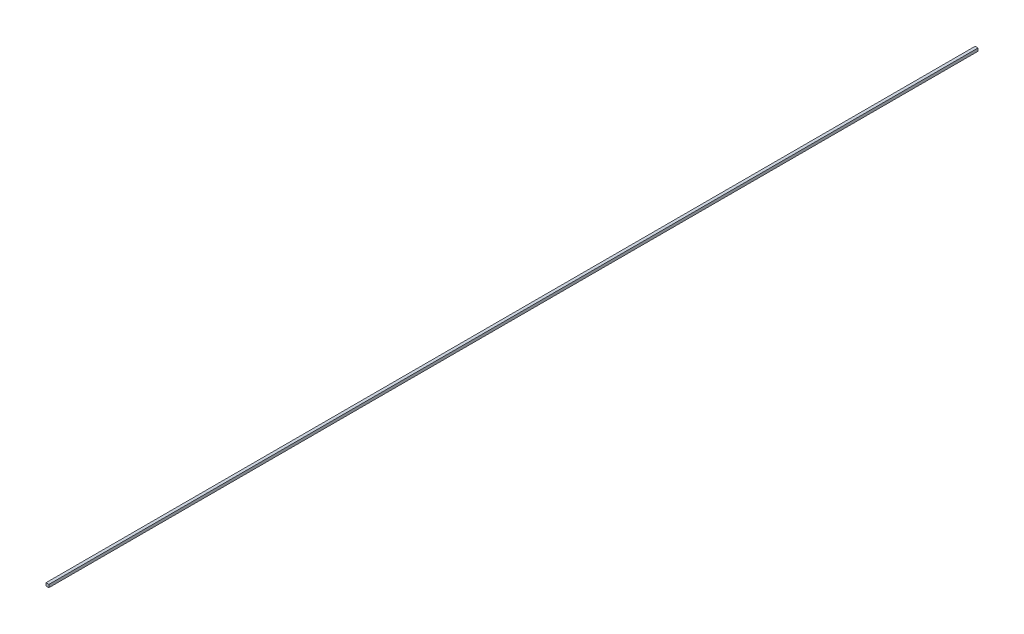
ISO-10303-21;
HEADER;
FILE_DESCRIPTION(('STEP AP214'),'2;1');
FILE_NAME('part.step','',(''),(''),'','','');
FILE_SCHEMA(('AUTOMOTIVE_DESIGN { 1 0 10303 214 1 1 1 1 }'));
ENDSEC;
DATA;
#1=APPLICATION_CONTEXT('core data for automotive mechanical design processes');
#2=APPLICATION_PROTOCOL_DEFINITION('international standard','automotive_design',2000,#1);
#3=PRODUCT_CONTEXT('',#1,'mechanical');
#4=PRODUCT('Part','Part','',(#3));
#5=PRODUCT_RELATED_PRODUCT_CATEGORY('part','',(#4));
#6=PRODUCT_DEFINITION_FORMATION('','',#4);
#7=PRODUCT_DEFINITION_CONTEXT('part definition',#1,'design');
#8=PRODUCT_DEFINITION('design','',#6,#7);
#9=PRODUCT_DEFINITION_SHAPE('','',#8);
#10=(LENGTH_UNIT() NAMED_UNIT(*) SI_UNIT(.MILLI.,.METRE.));
#11=(NAMED_UNIT(*) PLANE_ANGLE_UNIT() SI_UNIT($,.RADIAN.));
#12=(NAMED_UNIT(*) SI_UNIT($,.STERADIAN.) SOLID_ANGLE_UNIT());
#13=UNCERTAINTY_MEASURE_WITH_UNIT(LENGTH_MEASURE(1.E-05),#10,'distance_accuracy_value','');
#14=(GEOMETRIC_REPRESENTATION_CONTEXT(3) GLOBAL_UNCERTAINTY_ASSIGNED_CONTEXT((#13)) GLOBAL_UNIT_ASSIGNED_CONTEXT((#10,
#11,#12)) REPRESENTATION_CONTEXT('',''));
#15=CARTESIAN_POINT('',(0.,0.,0.));
#16=DIRECTION('',(0.,0.,1.));
#17=DIRECTION('',(1.,0.,0.));
#18=AXIS2_PLACEMENT_3D('',#15,#16,#17);
#19=CARTESIAN_POINT('',(1.,1.,640.8));
#20=DIRECTION('',(-1.,0.,0.));
#21=DIRECTION('',(0.,-1.,0.));
#22=AXIS2_PLACEMENT_3D('',#19,#20,#21);
#23=PLANE('',#22);
#24=DIRECTION('',(0.,1.,0.));
#25=VECTOR('',#24,1.);
#26=CARTESIAN_POINT('',(1.,1.,0.));
#27=LINE('',#26,#25);
#28=CARTESIAN_POINT('',(1.,-0.999999999999997,0.));
#29=VERTEX_POINT('',#28);
#30=CARTESIAN_POINT('',(1.,1.,0.));
#31=VERTEX_POINT('',#30);
#32=EDGE_CURVE('E107',#29,#31,#27,.T.);
#33=ORIENTED_EDGE('',*,*,#32,.T.);
#34=DIRECTION('',(0.,0.,-1.));
#35=VECTOR('',#34,1.);
#36=CARTESIAN_POINT('',(1.,1.,640.8));
#37=LINE('',#36,#35);
#38=CARTESIAN_POINT('',(1.,1.,640.8));
#39=VERTEX_POINT('',#38);
#40=EDGE_CURVE('E11',#39,#31,#37,.T.);
#41=ORIENTED_EDGE('',*,*,#40,.F.);
#42=DIRECTION('',(0.,1.,0.));
#43=VECTOR('',#42,1.);
#44=CARTESIAN_POINT('',(1.,1.,640.8));
#45=LINE('',#44,#43);
#46=CARTESIAN_POINT('',(1.,-0.999999999999997,640.8));
#47=VERTEX_POINT('',#46);
#48=EDGE_CURVE('E91',#47,#39,#45,.T.);
#49=ORIENTED_EDGE('',*,*,#48,.F.);
#50=DIRECTION('',(0.,0.,-1.));
#51=VECTOR('',#50,1.);
#52=CARTESIAN_POINT('',(1.,-0.999999999999997,640.8));
#53=LINE('',#52,#51);
#54=EDGE_CURVE('E103',#47,#29,#53,.T.);
#55=ORIENTED_EDGE('',*,*,#54,.T.);
#56=EDGE_LOOP('',(#33,#41,#49,#55));
#57=FACE_BOUND('',#56,.T.);
#58=ADVANCED_FACE('F39',(#57),#23,.F.);
#59=CARTESIAN_POINT('',(-0.999999999999996,1.,640.8));
#60=DIRECTION('',(0.,-1.,0.));
#61=DIRECTION('',(0.,0.,-1.));
#62=AXIS2_PLACEMENT_3D('',#59,#60,#61);
#63=PLANE('',#62);
#64=DIRECTION('',(-1.,0.,0.));
#65=VECTOR('',#64,1.);
#66=CARTESIAN_POINT('',(-0.999999999999996,1.,0.));
#67=LINE('',#66,#65);
#68=CARTESIAN_POINT('',(-0.999999999999996,1.,0.));
#69=VERTEX_POINT('',#68);
#70=EDGE_CURVE('E96',#31,#69,#67,.T.);
#71=ORIENTED_EDGE('',*,*,#70,.T.);
#72=DIRECTION('',(0.,0.,-1.));
#73=VECTOR('',#72,1.);
#74=CARTESIAN_POINT('',(-0.999999999999996,1.,640.8));
#75=LINE('',#74,#73);
#76=CARTESIAN_POINT('',(-0.999999999999996,1.,640.8));
#77=VERTEX_POINT('',#76);
#78=EDGE_CURVE('E48',#77,#69,#75,.T.);
#79=ORIENTED_EDGE('',*,*,#78,.F.);
#80=DIRECTION('',(-1.,0.,0.));
#81=VECTOR('',#80,1.);
#82=CARTESIAN_POINT('',(-0.999999999999996,1.,640.8));
#83=LINE('',#82,#81);
#84=EDGE_CURVE('E86',#39,#77,#83,.T.);
#85=ORIENTED_EDGE('',*,*,#84,.F.);
#86=ORIENTED_EDGE('',*,*,#40,.T.);
#87=EDGE_LOOP('',(#71,#79,#85,#86));
#88=FACE_BOUND('',#87,.T.);
#89=ADVANCED_FACE('F95',(#88),#63,.F.);
#90=CARTESIAN_POINT('',(-0.999999999999996,1.,640.8));
#91=DIRECTION('',(1.,0.,0.));
#92=DIRECTION('',(0.,1.,0.));
#93=AXIS2_PLACEMENT_3D('',#90,#91,#92);
#94=PLANE('',#93);
#95=DIRECTION('',(0.,-1.,0.));
#96=VECTOR('',#95,1.);
#97=CARTESIAN_POINT('',(-0.999999999999996,1.,0.));
#98=LINE('',#97,#96);
#99=CARTESIAN_POINT('',(-0.999999999999995,-0.999999999999997,0.));
#100=VERTEX_POINT('',#99);
#101=EDGE_CURVE('E73',#69,#100,#98,.T.);
#102=ORIENTED_EDGE('',*,*,#101,.T.);
#103=DIRECTION('',(0.,0.,-1.));
#104=VECTOR('',#103,1.);
#105=CARTESIAN_POINT('',(-0.999999999999995,-0.999999999999997,640.8));
#106=LINE('',#105,#104);
#107=CARTESIAN_POINT('',(-0.999999999999995,-0.999999999999997,640.8));
#108=VERTEX_POINT('',#107);
#109=EDGE_CURVE('E98',#108,#100,#106,.T.);
#110=ORIENTED_EDGE('',*,*,#109,.F.);
#111=DIRECTION('',(0.,-1.,0.));
#112=VECTOR('',#111,1.);
#113=CARTESIAN_POINT('',(-0.999999999999996,1.,640.8));
#114=LINE('',#113,#112);
#115=EDGE_CURVE('E89',#77,#108,#114,.T.);
#116=ORIENTED_EDGE('',*,*,#115,.F.);
#117=ORIENTED_EDGE('',*,*,#78,.T.);
#118=EDGE_LOOP('',(#102,#110,#116,#117));
#119=FACE_BOUND('',#118,.T.);
#120=ADVANCED_FACE('F99',(#119),#94,.F.);
#121=CARTESIAN_POINT('',(-0.999999999999995,-0.999999999999997,640.8));
#122=DIRECTION('',(0.,1.,0.));
#123=DIRECTION('',(0.,0.,1.));
#124=AXIS2_PLACEMENT_3D('',#121,#122,#123);
#125=PLANE('',#124);
#126=DIRECTION('',(1.,0.,0.));
#127=VECTOR('',#126,1.);
#128=CARTESIAN_POINT('',(-0.999999999999995,-0.999999999999997,0.));
#129=LINE('',#128,#127);
#130=EDGE_CURVE('E79',#100,#29,#129,.T.);
#131=ORIENTED_EDGE('',*,*,#130,.T.);
#132=ORIENTED_EDGE('',*,*,#54,.F.);
#133=DIRECTION('',(1.,0.,0.));
#134=VECTOR('',#133,1.);
#135=CARTESIAN_POINT('',(-0.999999999999995,-0.999999999999997,640.8));
#136=LINE('',#135,#134);
#137=EDGE_CURVE('E56',#108,#47,#136,.T.);
#138=ORIENTED_EDGE('',*,*,#137,.F.);
#139=ORIENTED_EDGE('',*,*,#109,.T.);
#140=EDGE_LOOP('',(#131,#132,#138,#139));
#141=FACE_BOUND('',#140,.T.);
#142=ADVANCED_FACE('F120',(#141),#125,.F.);
#143=CARTESIAN_POINT('',(0.,0.,640.8));
#144=DIRECTION('',(0.,0.,1.));
#145=DIRECTION('',(1.,0.,0.));
#146=AXIS2_PLACEMENT_3D('',#143,#144,#145);
#147=PLANE('',#146);
#148=ORIENTED_EDGE('',*,*,#48,.T.);
#149=ORIENTED_EDGE('',*,*,#84,.T.);
#150=ORIENTED_EDGE('',*,*,#115,.T.);
#151=ORIENTED_EDGE('',*,*,#137,.T.);
#152=EDGE_LOOP('',(#148,#149,#150,#151));
#153=FACE_BOUND('',#152,.T.);
#154=ADVANCED_FACE('F87',(#153),#147,.T.);
#155=CARTESIAN_POINT('',(0.,0.,0.));
#156=DIRECTION('',(0.,0.,1.));
#157=DIRECTION('',(1.,0.,0.));
#158=AXIS2_PLACEMENT_3D('',#155,#156,#157);
#159=PLANE('',#158);
#160=ORIENTED_EDGE('',*,*,#32,.F.);
#161=ORIENTED_EDGE('',*,*,#130,.F.);
#162=ORIENTED_EDGE('',*,*,#101,.F.);
#163=ORIENTED_EDGE('',*,*,#70,.F.);
#164=EDGE_LOOP('',(#160,#161,#162,#163));
#165=FACE_BOUND('',#164,.T.);
#166=ADVANCED_FACE('F123',(#165),#159,.F.);
#167=CLOSED_SHELL('',(#58,#89,#120,#142,#154,#166));
#168=MANIFOLD_SOLID_BREP('B2',#167);
#169=ADVANCED_BREP_SHAPE_REPRESENTATION('',(#18,#168),#14);
#170=SHAPE_DEFINITION_REPRESENTATION(#9,#169);
ENDSEC;
END-ISO-10303-21;
